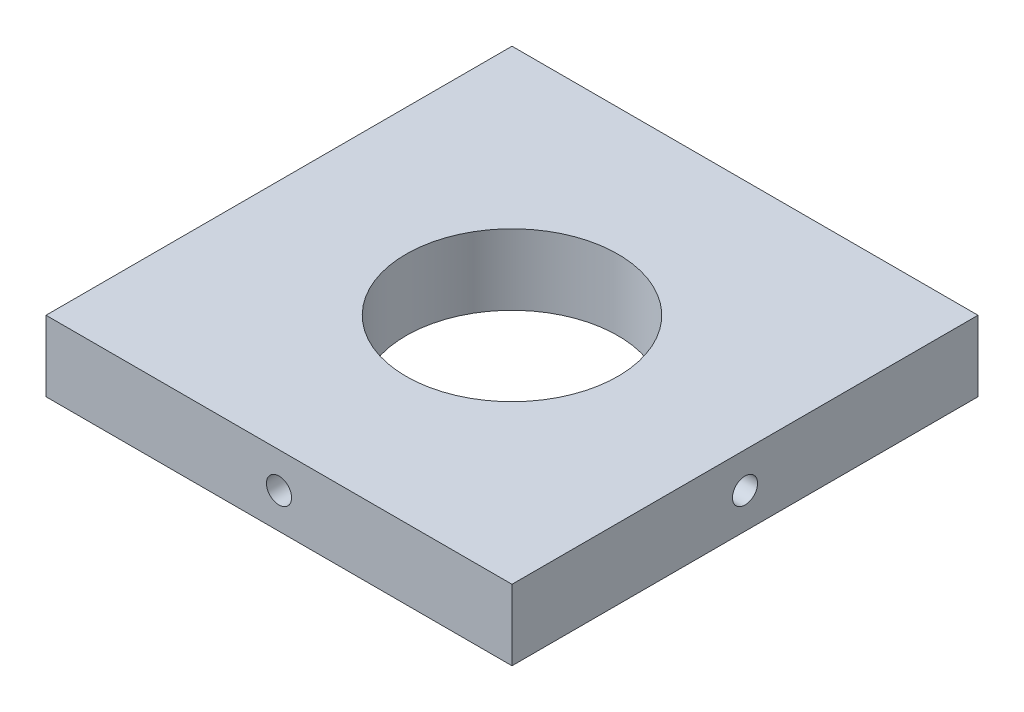
ISO-10303-21;
HEADER;
FILE_DESCRIPTION(('STEP AP214'),'2;1');
FILE_NAME('part.step','',(''),(''),'','','');
FILE_SCHEMA(('AUTOMOTIVE_DESIGN { 1 0 10303 214 1 1 1 1 }'));
ENDSEC;
DATA;
#1=APPLICATION_CONTEXT('core data for automotive mechanical design processes');
#2=APPLICATION_PROTOCOL_DEFINITION('international standard','automotive_design',2000,#1);
#3=PRODUCT_CONTEXT('',#1,'mechanical');
#4=PRODUCT('Part','Part','',(#3));
#5=PRODUCT_RELATED_PRODUCT_CATEGORY('part','',(#4));
#6=PRODUCT_DEFINITION_FORMATION('','',#4);
#7=PRODUCT_DEFINITION_CONTEXT('part definition',#1,'design');
#8=PRODUCT_DEFINITION('design','',#6,#7);
#9=PRODUCT_DEFINITION_SHAPE('','',#8);
#10=(LENGTH_UNIT() NAMED_UNIT(*) SI_UNIT(.MILLI.,.METRE.));
#11=(NAMED_UNIT(*) PLANE_ANGLE_UNIT() SI_UNIT($,.RADIAN.));
#12=(NAMED_UNIT(*) SI_UNIT($,.STERADIAN.) SOLID_ANGLE_UNIT());
#13=UNCERTAINTY_MEASURE_WITH_UNIT(LENGTH_MEASURE(1.E-05),#10,'distance_accuracy_value','');
#14=(GEOMETRIC_REPRESENTATION_CONTEXT(3) GLOBAL_UNCERTAINTY_ASSIGNED_CONTEXT((#13)) GLOBAL_UNIT_ASSIGNED_CONTEXT((#10,
#11,#12)) REPRESENTATION_CONTEXT('',''));
#15=CARTESIAN_POINT('',(0.,0.,0.));
#16=DIRECTION('',(0.,0.,1.));
#17=DIRECTION('',(1.,0.,0.));
#18=AXIS2_PLACEMENT_3D('',#15,#16,#17);
#19=CARTESIAN_POINT('',(0.,5.,0.));
#20=DIRECTION('',(0.,-1.,0.));
#21=DIRECTION('',(0.,0.,-1.));
#22=AXIS2_PLACEMENT_3D('',#19,#20,#21);
#23=PLANE('',#22);
#24=DIRECTION('',(0.,0.,1.));
#25=VECTOR('',#24,1.);
#26=CARTESIAN_POINT('',(-16.5,5.,16.5));
#27=LINE('',#26,#25);
#28=CARTESIAN_POINT('',(-16.5,5.,-16.5));
#29=VERTEX_POINT('',#28);
#30=CARTESIAN_POINT('',(-16.5,5.,16.5));
#31=VERTEX_POINT('',#30);
#32=EDGE_CURVE('E155',#29,#31,#27,.T.);
#33=ORIENTED_EDGE('',*,*,#32,.T.);
#34=DIRECTION('',(1.,0.,0.));
#35=VECTOR('',#34,1.);
#36=CARTESIAN_POINT('',(-16.5,5.,16.5));
#37=LINE('',#36,#35);
#38=CARTESIAN_POINT('',(16.5,5.,16.5));
#39=VERTEX_POINT('',#38);
#40=EDGE_CURVE('E92',#31,#39,#37,.T.);
#41=ORIENTED_EDGE('',*,*,#40,.T.);
#42=DIRECTION('',(0.,0.,-1.));
#43=VECTOR('',#42,1.);
#44=CARTESIAN_POINT('',(16.5,5.,16.5));
#45=LINE('',#44,#43);
#46=CARTESIAN_POINT('',(16.5,5.,-16.5));
#47=VERTEX_POINT('',#46);
#48=EDGE_CURVE('E160',#39,#47,#45,.T.);
#49=ORIENTED_EDGE('',*,*,#48,.T.);
#50=DIRECTION('',(-1.,0.,0.));
#51=VECTOR('',#50,1.);
#52=CARTESIAN_POINT('',(-16.5,5.,-16.5));
#53=LINE('',#52,#51);
#54=EDGE_CURVE('E61',#47,#29,#53,.T.);
#55=ORIENTED_EDGE('',*,*,#54,.T.);
#56=EDGE_LOOP('',(#33,#41,#49,#55));
#57=FACE_BOUND('',#56,.T.);
#58=CARTESIAN_POINT('',(0.,5.,0.));
#59=DIRECTION('',(0.,1.,0.));
#60=DIRECTION('',(0.,0.,1.));
#61=AXIS2_PLACEMENT_3D('',#58,#59,#60);
#62=CIRCLE('',#61,7.5);
#63=CARTESIAN_POINT('',(0.,5.,7.5));
#64=VERTEX_POINT('',#63);
#65=EDGE_CURVE('E147',#64,#64,#62,.T.);
#66=ORIENTED_EDGE('',*,*,#65,.F.);
#67=EDGE_LOOP('',(#66));
#68=FACE_BOUND('',#67,.T.);
#69=ADVANCED_FACE('F43',(#57,#68),#23,.F.);
#70=CARTESIAN_POINT('',(0.,0.,0.));
#71=DIRECTION('',(0.,-1.,0.));
#72=DIRECTION('',(0.,0.,-1.));
#73=AXIS2_PLACEMENT_3D('',#70,#71,#72);
#74=PLANE('',#73);
#75=DIRECTION('',(0.,0.,1.));
#76=VECTOR('',#75,1.);
#77=CARTESIAN_POINT('',(-16.5,0.,16.5));
#78=LINE('',#77,#76);
#79=CARTESIAN_POINT('',(-16.5,0.,-16.5));
#80=VERTEX_POINT('',#79);
#81=CARTESIAN_POINT('',(-16.5,0.,16.5));
#82=VERTEX_POINT('',#81);
#83=EDGE_CURVE('E151',#80,#82,#78,.T.);
#84=ORIENTED_EDGE('',*,*,#83,.F.);
#85=DIRECTION('',(-1.,0.,0.));
#86=VECTOR('',#85,1.);
#87=CARTESIAN_POINT('',(-16.5,0.,-16.5));
#88=LINE('',#87,#86);
#89=CARTESIAN_POINT('',(16.5,0.,-16.5));
#90=VERTEX_POINT('',#89);
#91=EDGE_CURVE('E85',#90,#80,#88,.T.);
#92=ORIENTED_EDGE('',*,*,#91,.F.);
#93=DIRECTION('',(0.,0.,-1.));
#94=VECTOR('',#93,1.);
#95=CARTESIAN_POINT('',(16.5,0.,16.5));
#96=LINE('',#95,#94);
#97=CARTESIAN_POINT('',(16.5,0.,16.5));
#98=VERTEX_POINT('',#97);
#99=EDGE_CURVE('E79',#98,#90,#96,.T.);
#100=ORIENTED_EDGE('',*,*,#99,.F.);
#101=DIRECTION('',(1.,0.,0.));
#102=VECTOR('',#101,1.);
#103=CARTESIAN_POINT('',(-16.5,0.,16.5));
#104=LINE('',#103,#102);
#105=EDGE_CURVE('E169',#82,#98,#104,.T.);
#106=ORIENTED_EDGE('',*,*,#105,.F.);
#107=EDGE_LOOP('',(#84,#92,#100,#106));
#108=FACE_BOUND('',#107,.T.);
#109=CARTESIAN_POINT('',(0.,0.,0.));
#110=DIRECTION('',(0.,1.,0.));
#111=DIRECTION('',(0.,0.,1.));
#112=AXIS2_PLACEMENT_3D('',#109,#110,#111);
#113=CIRCLE('',#112,7.5);
#114=CARTESIAN_POINT('',(0.,0.,7.5));
#115=VERTEX_POINT('',#114);
#116=EDGE_CURVE('E146',#115,#115,#113,.T.);
#117=ORIENTED_EDGE('',*,*,#116,.T.);
#118=EDGE_LOOP('',(#117));
#119=FACE_BOUND('',#118,.T.);
#120=ADVANCED_FACE('F185',(#108,#119),#74,.T.);
#121=CARTESIAN_POINT('',(-16.5,5.,16.5));
#122=DIRECTION('',(1.,0.,0.));
#123=DIRECTION('',(0.,0.,-1.));
#124=AXIS2_PLACEMENT_3D('',#121,#122,#123);
#125=PLANE('',#124);
#126=CARTESIAN_POINT('',(-16.5,2.5,0.));
#127=DIRECTION('',(-1.,0.,0.));
#128=DIRECTION('',(0.,0.,1.));
#129=AXIS2_PLACEMENT_3D('',#126,#127,#128);
#130=CIRCLE('',#129,0.888999999999989);
#131=CARTESIAN_POINT('',(-16.5,2.5,0.88899999999998));
#132=VERTEX_POINT('',#131);
#133=EDGE_CURVE('E117',#132,#132,#130,.T.);
#134=ORIENTED_EDGE('',*,*,#133,.F.);
#135=EDGE_LOOP('',(#134));
#136=FACE_BOUND('',#135,.T.);
#137=ORIENTED_EDGE('',*,*,#83,.T.);
#138=DIRECTION('',(0.,-1.,0.));
#139=VECTOR('',#138,1.);
#140=CARTESIAN_POINT('',(-16.5,5.,16.5));
#141=LINE('',#140,#139);
#142=EDGE_CURVE('E11',#31,#82,#141,.T.);
#143=ORIENTED_EDGE('',*,*,#142,.F.);
#144=ORIENTED_EDGE('',*,*,#32,.F.);
#145=DIRECTION('',(0.,-1.,0.));
#146=VECTOR('',#145,1.);
#147=CARTESIAN_POINT('',(-16.5,5.,-16.5));
#148=LINE('',#147,#146);
#149=EDGE_CURVE('E165',#29,#80,#148,.T.);
#150=ORIENTED_EDGE('',*,*,#149,.T.);
#151=EDGE_LOOP('',(#137,#143,#144,#150));
#152=FACE_BOUND('',#151,.T.);
#153=ADVANCED_FACE('F45',(#136,#152),#125,.F.);
#154=CARTESIAN_POINT('',(-16.5,5.,16.5));
#155=DIRECTION('',(0.,0.,-1.));
#156=DIRECTION('',(-1.,0.,0.));
#157=AXIS2_PLACEMENT_3D('',#154,#155,#156);
#158=PLANE('',#157);
#159=CARTESIAN_POINT('',(0.,2.5,16.5));
#160=DIRECTION('',(0.,0.,1.));
#161=DIRECTION('',(1.,0.,0.));
#162=AXIS2_PLACEMENT_3D('',#159,#160,#161);
#163=CIRCLE('',#162,0.888999999999989);
#164=CARTESIAN_POINT('',(0.888999999999985,2.5,16.5));
#165=VERTEX_POINT('',#164);
#166=EDGE_CURVE('E138',#165,#165,#163,.T.);
#167=ORIENTED_EDGE('',*,*,#166,.F.);
#168=EDGE_LOOP('',(#167));
#169=FACE_BOUND('',#168,.T.);
#170=ORIENTED_EDGE('',*,*,#105,.T.);
#171=DIRECTION('',(0.,-1.,0.));
#172=VECTOR('',#171,1.);
#173=CARTESIAN_POINT('',(16.5,5.,16.5));
#174=LINE('',#173,#172);
#175=EDGE_CURVE('E53',#39,#98,#174,.T.);
#176=ORIENTED_EDGE('',*,*,#175,.F.);
#177=ORIENTED_EDGE('',*,*,#40,.F.);
#178=ORIENTED_EDGE('',*,*,#142,.T.);
#179=EDGE_LOOP('',(#170,#176,#177,#178));
#180=FACE_BOUND('',#179,.T.);
#181=ADVANCED_FACE('F202',(#169,#180),#158,.F.);
#182=CARTESIAN_POINT('',(16.5,5.,16.5));
#183=DIRECTION('',(-1.,0.,0.));
#184=DIRECTION('',(0.,0.,1.));
#185=AXIS2_PLACEMENT_3D('',#182,#183,#184);
#186=PLANE('',#185);
#187=CARTESIAN_POINT('',(16.5,2.5,0.));
#188=DIRECTION('',(1.,0.,0.));
#189=DIRECTION('',(0.,0.,-1.));
#190=AXIS2_PLACEMENT_3D('',#187,#188,#189);
#191=CIRCLE('',#190,0.888999999999989);
#192=CARTESIAN_POINT('',(16.5,2.5,-0.888999999999985));
#193=VERTEX_POINT('',#192);
#194=EDGE_CURVE('E116',#193,#193,#191,.T.);
#195=ORIENTED_EDGE('',*,*,#194,.F.);
#196=EDGE_LOOP('',(#195));
#197=FACE_BOUND('',#196,.T.);
#198=ORIENTED_EDGE('',*,*,#99,.T.);
#199=DIRECTION('',(0.,-1.,0.));
#200=VECTOR('',#199,1.);
#201=CARTESIAN_POINT('',(16.5,5.,-16.5));
#202=LINE('',#201,#200);
#203=EDGE_CURVE('E178',#47,#90,#202,.T.);
#204=ORIENTED_EDGE('',*,*,#203,.F.);
#205=ORIENTED_EDGE('',*,*,#48,.F.);
#206=ORIENTED_EDGE('',*,*,#175,.T.);
#207=EDGE_LOOP('',(#198,#204,#205,#206));
#208=FACE_BOUND('',#207,.T.);
#209=ADVANCED_FACE('F182',(#197,#208),#186,.F.);
#210=CARTESIAN_POINT('',(-16.5,5.,-16.5));
#211=DIRECTION('',(0.,0.,1.));
#212=DIRECTION('',(1.,0.,0.));
#213=AXIS2_PLACEMENT_3D('',#210,#211,#212);
#214=PLANE('',#213);
#215=CARTESIAN_POINT('',(0.,2.5,-16.5));
#216=DIRECTION('',(0.,0.,-1.));
#217=DIRECTION('',(-1.,0.,0.));
#218=AXIS2_PLACEMENT_3D('',#215,#216,#217);
#219=CIRCLE('',#218,0.888999999999989);
#220=CARTESIAN_POINT('',(-0.888999999999992,2.5,-16.5));
#221=VERTEX_POINT('',#220);
#222=EDGE_CURVE('E130',#221,#221,#219,.T.);
#223=ORIENTED_EDGE('',*,*,#222,.F.);
#224=EDGE_LOOP('',(#223));
#225=FACE_BOUND('',#224,.T.);
#226=ORIENTED_EDGE('',*,*,#91,.T.);
#227=ORIENTED_EDGE('',*,*,#149,.F.);
#228=ORIENTED_EDGE('',*,*,#54,.F.);
#229=ORIENTED_EDGE('',*,*,#203,.T.);
#230=EDGE_LOOP('',(#226,#227,#228,#229));
#231=FACE_BOUND('',#230,.T.);
#232=ADVANCED_FACE('F190',(#225,#231),#214,.F.);
#233=CARTESIAN_POINT('',(0.,5.,0.));
#234=DIRECTION('',(0.,-1.,0.));
#235=DIRECTION('',(0.,0.,-1.));
#236=AXIS2_PLACEMENT_3D('',#233,#234,#235);
#237=CYLINDRICAL_SURFACE('',#236,7.5);
#238=ORIENTED_EDGE('',*,*,#65,.T.);
#239=EDGE_LOOP('',(#238));
#240=FACE_BOUND('',#239,.T.);
#241=ORIENTED_EDGE('',*,*,#116,.F.);
#242=EDGE_LOOP('',(#241));
#243=FACE_BOUND('',#242,.T.);
#244=ADVANCED_FACE('F192',(#240,#243),#237,.F.);
#245=CARTESIAN_POINT('',(0.,2.5,10.0341650903155));
#246=DIRECTION('',(0.,0.,1.));
#247=DIRECTION('',(1.,0.,0.));
#248=AXIS2_PLACEMENT_3D('',#245,#246,#247);
#249=CONICAL_SURFACE('',#248,0.888999999999998,1.02974425867665);
#250=CARTESIAN_POINT('',(0.,2.5,9.5));
#251=VERTEX_POINT('',#250);
#252=VERTEX_LOOP('',#251);
#253=FACE_BOUND('',#252,.T.);
#254=CARTESIAN_POINT('',(0.,2.5,10.0341650903155));
#255=DIRECTION('',(0.,0.,1.));
#256=DIRECTION('',(1.,0.,0.));
#257=AXIS2_PLACEMENT_3D('',#254,#255,#256);
#258=CIRCLE('',#257,0.888999999999998);
#259=CARTESIAN_POINT('',(0.888999999999995,2.5,10.0341650903155));
#260=VERTEX_POINT('',#259);
#261=EDGE_CURVE('E142',#260,#260,#258,.T.);
#262=ORIENTED_EDGE('',*,*,#261,.T.);
#263=EDGE_LOOP('',(#262));
#264=FACE_BOUND('',#263,.T.);
#265=ADVANCED_FACE('F199',(#253,#264),#249,.F.);
#266=CARTESIAN_POINT('',(0.,2.5,16.5));
#267=DIRECTION('',(0.,0.,1.));
#268=DIRECTION('',(1.,0.,0.));
#269=AXIS2_PLACEMENT_3D('',#266,#267,#268);
#270=CYLINDRICAL_SURFACE('',#269,0.888999999999994);
#271=ORIENTED_EDGE('',*,*,#261,.F.);
#272=EDGE_LOOP('',(#271));
#273=FACE_BOUND('',#272,.T.);
#274=ORIENTED_EDGE('',*,*,#166,.T.);
#275=EDGE_LOOP('',(#274));
#276=FACE_BOUND('',#275,.T.);
#277=ADVANCED_FACE('F216',(#273,#276),#270,.F.);
#278=CARTESIAN_POINT('',(0.,2.5,-9.0341650903155));
#279=DIRECTION('',(0.,0.,-1.));
#280=DIRECTION('',(-1.,0.,0.));
#281=AXIS2_PLACEMENT_3D('',#278,#279,#280);
#282=CONICAL_SURFACE('',#281,0.888999999999998,1.02974425867665);
#283=CARTESIAN_POINT('',(0.,2.5,-8.5));
#284=VERTEX_POINT('',#283);
#285=VERTEX_LOOP('',#284);
#286=FACE_BOUND('',#285,.T.);
#287=CARTESIAN_POINT('',(0.,2.5,-9.0341650903155));
#288=DIRECTION('',(0.,0.,-1.));
#289=DIRECTION('',(-1.,0.,0.));
#290=AXIS2_PLACEMENT_3D('',#287,#288,#289);
#291=CIRCLE('',#290,0.888999999999998);
#292=CARTESIAN_POINT('',(-0.889000000000001,2.5,-9.0341650903155));
#293=VERTEX_POINT('',#292);
#294=EDGE_CURVE('E134',#293,#293,#291,.T.);
#295=ORIENTED_EDGE('',*,*,#294,.T.);
#296=EDGE_LOOP('',(#295));
#297=FACE_BOUND('',#296,.T.);
#298=ADVANCED_FACE('F220',(#286,#297),#282,.F.);
#299=CARTESIAN_POINT('',(0.,2.5,-16.5));
#300=DIRECTION('',(0.,0.,-1.));
#301=DIRECTION('',(-1.,0.,0.));
#302=AXIS2_PLACEMENT_3D('',#299,#300,#301);
#303=CYLINDRICAL_SURFACE('',#302,0.888999999999993);
#304=ORIENTED_EDGE('',*,*,#294,.F.);
#305=EDGE_LOOP('',(#304));
#306=FACE_BOUND('',#305,.T.);
#307=ORIENTED_EDGE('',*,*,#222,.T.);
#308=EDGE_LOOP('',(#307));
#309=FACE_BOUND('',#308,.T.);
#310=ADVANCED_FACE('F224',(#306,#309),#303,.F.);
#311=CARTESIAN_POINT('',(9.0341650903155,2.5,0.));
#312=DIRECTION('',(1.,0.,0.));
#313=DIRECTION('',(0.,0.,-1.));
#314=AXIS2_PLACEMENT_3D('',#311,#312,#313);
#315=CONICAL_SURFACE('',#314,0.888999999999998,1.02974425867665);
#316=CARTESIAN_POINT('',(8.5,2.5,0.));
#317=VERTEX_POINT('',#316);
#318=VERTEX_LOOP('',#317);
#319=FACE_BOUND('',#318,.T.);
#320=CARTESIAN_POINT('',(9.0341650903155,2.5,0.));
#321=DIRECTION('',(1.,0.,0.));
#322=DIRECTION('',(0.,0.,-1.));
#323=AXIS2_PLACEMENT_3D('',#320,#321,#322);
#324=CIRCLE('',#323,0.888999999999998);
#325=CARTESIAN_POINT('',(9.0341650903155,2.5,-0.888999999999994));
#326=VERTEX_POINT('',#325);
#327=EDGE_CURVE('E122',#326,#326,#324,.T.);
#328=ORIENTED_EDGE('',*,*,#327,.T.);
#329=EDGE_LOOP('',(#328));
#330=FACE_BOUND('',#329,.T.);
#331=ADVANCED_FACE('F228',(#319,#330),#315,.F.);
#332=CARTESIAN_POINT('',(16.5,2.5,0.));
#333=DIRECTION('',(1.,0.,0.));
#334=DIRECTION('',(0.,0.,-1.));
#335=AXIS2_PLACEMENT_3D('',#332,#333,#334);
#336=CYLINDRICAL_SURFACE('',#335,0.888999999999993);
#337=ORIENTED_EDGE('',*,*,#327,.F.);
#338=EDGE_LOOP('',(#337));
#339=FACE_BOUND('',#338,.T.);
#340=ORIENTED_EDGE('',*,*,#194,.T.);
#341=EDGE_LOOP('',(#340));
#342=FACE_BOUND('',#341,.T.);
#343=ADVANCED_FACE('F109',(#339,#342),#336,.F.);
#344=CARTESIAN_POINT('',(-9.0341650903155,2.5,0.));
#345=DIRECTION('',(-1.,0.,0.));
#346=DIRECTION('',(0.,0.,1.));
#347=AXIS2_PLACEMENT_3D('',#344,#345,#346);
#348=CONICAL_SURFACE('',#347,0.888999999999998,1.02974425867665);
#349=CARTESIAN_POINT('',(-8.49999999999999,2.5,0.));
#350=VERTEX_POINT('',#349);
#351=VERTEX_LOOP('',#350);
#352=FACE_BOUND('',#351,.T.);
#353=CARTESIAN_POINT('',(-9.0341650903155,2.5,0.));
#354=DIRECTION('',(-1.,0.,0.));
#355=DIRECTION('',(0.,0.,1.));
#356=AXIS2_PLACEMENT_3D('',#353,#354,#355);
#357=CIRCLE('',#356,0.888999999999998);
#358=CARTESIAN_POINT('',(-9.0341650903155,2.5,0.888999999999992));
#359=VERTEX_POINT('',#358);
#360=EDGE_CURVE('E113',#359,#359,#357,.T.);
#361=ORIENTED_EDGE('',*,*,#360,.T.);
#362=EDGE_LOOP('',(#361));
#363=FACE_BOUND('',#362,.T.);
#364=ADVANCED_FACE('F105',(#352,#363),#348,.F.);
#365=CARTESIAN_POINT('',(-16.5,2.5,0.));
#366=DIRECTION('',(-1.,0.,0.));
#367=DIRECTION('',(0.,0.,1.));
#368=AXIS2_PLACEMENT_3D('',#365,#366,#367);
#369=CYLINDRICAL_SURFACE('',#368,0.888999999999993);
#370=ORIENTED_EDGE('',*,*,#360,.F.);
#371=EDGE_LOOP('',(#370));
#372=FACE_BOUND('',#371,.T.);
#373=ORIENTED_EDGE('',*,*,#133,.T.);
#374=EDGE_LOOP('',(#373));
#375=FACE_BOUND('',#374,.T.);
#376=ADVANCED_FACE('F108',(#372,#375),#369,.F.);
#377=CLOSED_SHELL('',(#69,#120,#153,#181,#209,#232,#244,#265,#277,#298,#310,#331,#343,#364,#376));
#378=MANIFOLD_SOLID_BREP('B2',#377);
#379=ADVANCED_BREP_SHAPE_REPRESENTATION('',(#18,#378),#14);
#380=SHAPE_DEFINITION_REPRESENTATION(#9,#379);
ENDSEC;
END-ISO-10303-21;
